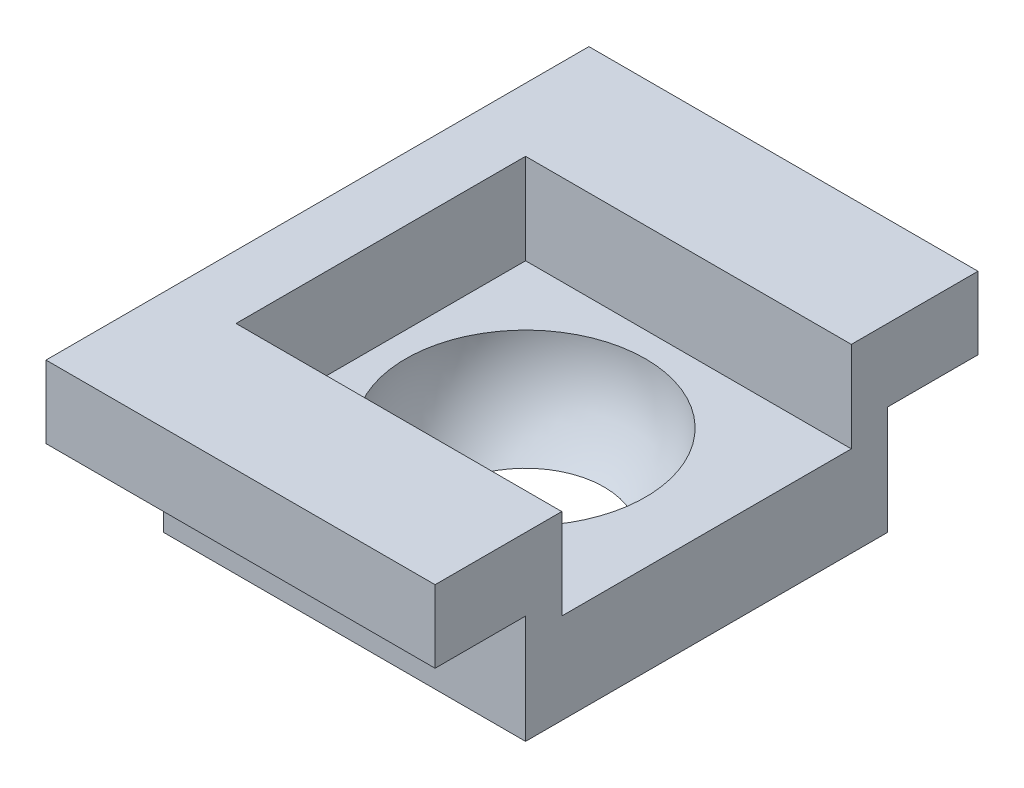
ISO-10303-21;
HEADER;
FILE_DESCRIPTION(('STEP AP214'),'2;1');
FILE_NAME('part.step','',(''),(''),'','','');
FILE_SCHEMA(('AUTOMOTIVE_DESIGN { 1 0 10303 214 1 1 1 1 }'));
ENDSEC;
DATA;
#1=APPLICATION_CONTEXT('core data for automotive mechanical design processes');
#2=APPLICATION_PROTOCOL_DEFINITION('international standard','automotive_design',2000,#1);
#3=PRODUCT_CONTEXT('',#1,'mechanical');
#4=PRODUCT('Part','Part','',(#3));
#5=PRODUCT_RELATED_PRODUCT_CATEGORY('part','',(#4));
#6=PRODUCT_DEFINITION_FORMATION('','',#4);
#7=PRODUCT_DEFINITION_CONTEXT('part definition',#1,'design');
#8=PRODUCT_DEFINITION('design','',#6,#7);
#9=PRODUCT_DEFINITION_SHAPE('','',#8);
#10=(LENGTH_UNIT() NAMED_UNIT(*) SI_UNIT(.MILLI.,.METRE.));
#11=(NAMED_UNIT(*) PLANE_ANGLE_UNIT() SI_UNIT($,.RADIAN.));
#12=(NAMED_UNIT(*) SI_UNIT($,.STERADIAN.) SOLID_ANGLE_UNIT());
#13=UNCERTAINTY_MEASURE_WITH_UNIT(LENGTH_MEASURE(1.E-05),#10,'distance_accuracy_value','');
#14=(GEOMETRIC_REPRESENTATION_CONTEXT(3) GLOBAL_UNCERTAINTY_ASSIGNED_CONTEXT((#13)) GLOBAL_UNIT_ASSIGNED_CONTEXT((#10,
#11,#12)) REPRESENTATION_CONTEXT('',''));
#15=CARTESIAN_POINT('',(0.,0.,0.));
#16=DIRECTION('',(0.,0.,1.));
#17=DIRECTION('',(1.,0.,0.));
#18=AXIS2_PLACEMENT_3D('',#15,#16,#17);
#19=CARTESIAN_POINT('',(-2.30598444461534,2.,-2.01602049593134));
#20=DIRECTION('',(1.,0.,0.));
#21=DIRECTION('',(0.,0.,-1.));
#22=AXIS2_PLACEMENT_3D('',#19,#20,#21);
#23=PLANE('',#22);
#24=DIRECTION('',(0.,0.,1.));
#25=VECTOR('',#24,1.);
#26=CARTESIAN_POINT('',(-2.30598444461534,2.2,-3.01602049593134));
#27=LINE('',#26,#25);
#28=CARTESIAN_POINT('',(-2.30598444461534,2.2,-2.01602049593134));
#29=VERTEX_POINT('',#28);
#30=CARTESIAN_POINT('',(-2.30598444461534,2.2,1.98397950406866));
#31=VERTEX_POINT('',#30);
#32=EDGE_CURVE('E11',#29,#31,#27,.T.);
#33=ORIENTED_EDGE('',*,*,#32,.F.);
#34=DIRECTION('',(0.,-1.,0.));
#35=VECTOR('',#34,1.);
#36=CARTESIAN_POINT('',(-2.30598444461534,2.,-2.01602049593134));
#37=LINE('',#36,#35);
#38=CARTESIAN_POINT('',(-2.30598444461534,1.,-2.01602049593134));
#39=VERTEX_POINT('',#38);
#40=EDGE_CURVE('E215',#29,#39,#37,.T.);
#41=ORIENTED_EDGE('',*,*,#40,.T.);
#42=DIRECTION('',(0.,0.,-1.));
#43=VECTOR('',#42,1.);
#44=CARTESIAN_POINT('',(-2.30598444461534,1.,-2.01602049593134));
#45=LINE('',#44,#43);
#46=CARTESIAN_POINT('',(-2.30598444461534,1.,1.98397950406866));
#47=VERTEX_POINT('',#46);
#48=EDGE_CURVE('E208',#47,#39,#45,.T.);
#49=ORIENTED_EDGE('',*,*,#48,.F.);
#50=DIRECTION('',(0.,-1.,0.));
#51=VECTOR('',#50,1.);
#52=CARTESIAN_POINT('',(-2.30598444461534,2.,1.98397950406866));
#53=LINE('',#52,#51);
#54=EDGE_CURVE('E44',#31,#47,#53,.T.);
#55=ORIENTED_EDGE('',*,*,#54,.F.);
#56=EDGE_LOOP('',(#33,#41,#49,#55));
#57=FACE_BOUND('',#56,.T.);
#58=ADVANCED_FACE('F36',(#57),#23,.F.);
#59=CARTESIAN_POINT('',(-2.30598444461534,2.,-2.01602049593134));
#60=DIRECTION('',(0.,0.,1.));
#61=DIRECTION('',(1.,0.,0.));
#62=AXIS2_PLACEMENT_3D('',#59,#60,#61);
#63=PLANE('',#62);
#64=DIRECTION('',(-1.,0.,0.));
#65=VECTOR('',#64,1.);
#66=CARTESIAN_POINT('',(1.69401555538492,2.2,-2.01602049593134));
#67=LINE('',#66,#65);
#68=CARTESIAN_POINT('',(1.69401555538466,2.2,-2.01602049593134));
#69=VERTEX_POINT('',#68);
#70=EDGE_CURVE('E52',#69,#29,#67,.T.);
#71=ORIENTED_EDGE('',*,*,#70,.F.);
#72=DIRECTION('',(0.,-1.,0.));
#73=VECTOR('',#72,1.);
#74=CARTESIAN_POINT('',(1.69401555538466,2.,-2.01602049593134));
#75=LINE('',#74,#73);
#76=CARTESIAN_POINT('',(1.69401555538466,1.,-2.01602049593134));
#77=VERTEX_POINT('',#76);
#78=EDGE_CURVE('E217',#69,#77,#75,.T.);
#79=ORIENTED_EDGE('',*,*,#78,.T.);
#80=DIRECTION('',(1.,0.,0.));
#81=VECTOR('',#80,1.);
#82=CARTESIAN_POINT('',(-2.30598444461534,1.,-2.01602049593134));
#83=LINE('',#82,#81);
#84=EDGE_CURVE('E199',#39,#77,#83,.T.);
#85=ORIENTED_EDGE('',*,*,#84,.F.);
#86=ORIENTED_EDGE('',*,*,#40,.F.);
#87=EDGE_LOOP('',(#71,#79,#85,#86));
#88=FACE_BOUND('',#87,.T.);
#89=ADVANCED_FACE('F246',(#88),#63,.F.);
#90=CARTESIAN_POINT('',(-2.30598444461534,2.,1.98397950406866));
#91=DIRECTION('',(0.,0.,-1.));
#92=DIRECTION('',(-1.,0.,0.));
#93=AXIS2_PLACEMENT_3D('',#90,#91,#92);
#94=PLANE('',#93);
#95=DIRECTION('',(1.,0.,0.));
#96=VECTOR('',#95,1.);
#97=CARTESIAN_POINT('',(-2.30598444461534,2.2,1.98397950406866));
#98=LINE('',#97,#96);
#99=CARTESIAN_POINT('',(1.69401555538492,2.2,1.98397950406866));
#100=VERTEX_POINT('',#99);
#101=EDGE_CURVE('E160',#31,#100,#98,.T.);
#102=ORIENTED_EDGE('',*,*,#101,.F.);
#103=ORIENTED_EDGE('',*,*,#54,.T.);
#104=DIRECTION('',(-1.,0.,0.));
#105=VECTOR('',#104,1.);
#106=CARTESIAN_POINT('',(-2.30598444461534,1.,1.98397950406866));
#107=LINE('',#106,#105);
#108=CARTESIAN_POINT('',(1.69401555538466,1.,1.98397950406866));
#109=VERTEX_POINT('',#108);
#110=EDGE_CURVE('E205',#109,#47,#107,.T.);
#111=ORIENTED_EDGE('',*,*,#110,.F.);
#112=DIRECTION('',(0.,-1.,0.));
#113=VECTOR('',#112,1.);
#114=CARTESIAN_POINT('',(1.69401555538466,2.,1.98397950406866));
#115=LINE('',#114,#113);
#116=EDGE_CURVE('E219',#100,#109,#115,.T.);
#117=ORIENTED_EDGE('',*,*,#116,.F.);
#118=EDGE_LOOP('',(#102,#103,#111,#117));
#119=FACE_BOUND('',#118,.T.);
#120=ADVANCED_FACE('F249',(#119),#94,.F.);
#121=CARTESIAN_POINT('',(0.,2.,0.));
#122=DIRECTION('',(0.,1.,0.));
#123=DIRECTION('',(0.,0.,1.));
#124=AXIS2_PLACEMENT_3D('',#121,#122,#123);
#125=PLANE('',#124);
#126=CARTESIAN_POINT('',(-0.305984444615342,2.,-0.0160204959313423));
#127=DIRECTION('',(0.,1.,0.));
#128=DIRECTION('',(0.,0.,1.));
#129=AXIS2_PLACEMENT_3D('',#126,#127,#128);
#130=CIRCLE('',#129,1.325);
#131=CARTESIAN_POINT('',(-0.305984444615342,2.,1.30897950406866));
#132=VERTEX_POINT('',#131);
#133=EDGE_CURVE('E211',#132,#132,#130,.F.);
#134=ORIENTED_EDGE('',*,*,#133,.T.);
#135=EDGE_LOOP('',(#134));
#136=FACE_BOUND('',#135,.T.);
#137=DIRECTION('',(0.,0.,-1.));
#138=VECTOR('',#137,1.);
#139=CARTESIAN_POINT('',(1.69401555538466,2.,-2.01602049593134));
#140=LINE('',#139,#138);
#141=CARTESIAN_POINT('',(1.69401555538466,2.,1.58397950406866));
#142=VERTEX_POINT('',#141);
#143=CARTESIAN_POINT('',(1.69401555538492,2.,-1.61602049593134));
#144=VERTEX_POINT('',#143);
#145=EDGE_CURVE('E212',#142,#144,#140,.T.);
#146=ORIENTED_EDGE('',*,*,#145,.T.);
#147=DIRECTION('',(1.,0.,0.));
#148=VECTOR('',#147,1.);
#149=CARTESIAN_POINT('',(1.51502065671139,2.,-1.61602049593134));
#150=LINE('',#149,#148);
#151=CARTESIAN_POINT('',(-1.90598444461534,2.,-1.61602049593134));
#152=VERTEX_POINT('',#151);
#153=EDGE_CURVE('E187',#152,#144,#150,.T.);
#154=ORIENTED_EDGE('',*,*,#153,.F.);
#155=DIRECTION('',(0.,0.,-1.));
#156=VECTOR('',#155,1.);
#157=CARTESIAN_POINT('',(-1.90598444461534,2.,1.58397950406866));
#158=LINE('',#157,#156);
#159=CARTESIAN_POINT('',(-1.90598444461534,2.,1.58397950406866));
#160=VERTEX_POINT('',#159);
#161=EDGE_CURVE('E171',#160,#152,#158,.T.);
#162=ORIENTED_EDGE('',*,*,#161,.F.);
#163=DIRECTION('',(-1.,0.,0.));
#164=VECTOR('',#163,1.);
#165=CARTESIAN_POINT('',(-1.90598444461534,2.,1.58397950406866));
#166=LINE('',#165,#164);
#167=EDGE_CURVE('E176',#142,#160,#166,.T.);
#168=ORIENTED_EDGE('',*,*,#167,.F.);
#169=EDGE_LOOP('',(#146,#154,#162,#168));
#170=FACE_BOUND('',#169,.T.);
#171=ADVANCED_FACE('F224',(#136,#170),#125,.T.);
#172=CARTESIAN_POINT('',(1.69401555538466,2.,-2.01602049593134));
#173=DIRECTION('',(-1.,0.,0.));
#174=DIRECTION('',(0.,0.,1.));
#175=AXIS2_PLACEMENT_3D('',#172,#173,#174);
#176=PLANE('',#175);
#177=DIRECTION('',(0.,0.,1.));
#178=VECTOR('',#177,1.);
#179=CARTESIAN_POINT('',(1.69401555538466,1.,-2.01602049593134));
#180=LINE('',#179,#178);
#181=EDGE_CURVE('E202',#77,#109,#180,.T.);
#182=ORIENTED_EDGE('',*,*,#181,.F.);
#183=ORIENTED_EDGE('',*,*,#78,.F.);
#184=DIRECTION('',(0.,0.,1.));
#185=VECTOR('',#184,1.);
#186=CARTESIAN_POINT('',(1.69401555538492,2.2,-3.01602049593134));
#187=LINE('',#186,#185);
#188=CARTESIAN_POINT('',(1.69401555538492,2.2,-3.01602049593134));
#189=VERTEX_POINT('',#188);
#190=EDGE_CURVE('E157',#189,#69,#187,.T.);
#191=ORIENTED_EDGE('',*,*,#190,.F.);
#192=DIRECTION('',(0.,-1.,0.));
#193=VECTOR('',#192,1.);
#194=CARTESIAN_POINT('',(1.69401555538492,3.,-3.01602049593134));
#195=LINE('',#194,#193);
#196=CARTESIAN_POINT('',(1.69401555538492,3.,-3.01602049593134));
#197=VERTEX_POINT('',#196);
#198=EDGE_CURVE('E132',#197,#189,#195,.T.);
#199=ORIENTED_EDGE('',*,*,#198,.F.);
#200=DIRECTION('',(0.,0.,-1.));
#201=VECTOR('',#200,1.);
#202=CARTESIAN_POINT('',(1.69401555538492,3.,-1.61602049593134));
#203=LINE('',#202,#201);
#204=CARTESIAN_POINT('',(1.69401555538492,3.,-1.61602049593134));
#205=VERTEX_POINT('',#204);
#206=EDGE_CURVE('E178',#205,#197,#203,.T.);
#207=ORIENTED_EDGE('',*,*,#206,.F.);
#208=DIRECTION('',(0.,-1.,0.));
#209=VECTOR('',#208,1.);
#210=CARTESIAN_POINT('',(1.69401555538492,3.,-1.61602049593134));
#211=LINE('',#210,#209);
#212=EDGE_CURVE('E194',#205,#144,#211,.T.);
#213=ORIENTED_EDGE('',*,*,#212,.T.);
#214=ORIENTED_EDGE('',*,*,#145,.F.);
#215=DIRECTION('',(0.,-1.,0.));
#216=VECTOR('',#215,1.);
#217=CARTESIAN_POINT('',(1.69401555538492,3.,1.58397950406866));
#218=LINE('',#217,#216);
#219=CARTESIAN_POINT('',(1.69401555538492,3.,1.58397950406866));
#220=VERTEX_POINT('',#219);
#221=EDGE_CURVE('E192',#220,#142,#218,.T.);
#222=ORIENTED_EDGE('',*,*,#221,.F.);
#223=DIRECTION('',(0.,0.,-1.));
#224=VECTOR('',#223,1.);
#225=CARTESIAN_POINT('',(1.69401555538492,3.,1.98397950406866));
#226=LINE('',#225,#224);
#227=CARTESIAN_POINT('',(1.69401555538492,3.,2.98397950406866));
#228=VERTEX_POINT('',#227);
#229=EDGE_CURVE('E180',#228,#220,#226,.T.);
#230=ORIENTED_EDGE('',*,*,#229,.F.);
#231=DIRECTION('',(0.,1.,0.));
#232=VECTOR('',#231,1.);
#233=CARTESIAN_POINT('',(1.69401555538492,3.,2.98397950406866));
#234=LINE('',#233,#232);
#235=CARTESIAN_POINT('',(1.69401555538492,2.2,2.98397950406866));
#236=VERTEX_POINT('',#235);
#237=EDGE_CURVE('E162',#236,#228,#234,.T.);
#238=ORIENTED_EDGE('',*,*,#237,.F.);
#239=DIRECTION('',(0.,0.,-1.));
#240=VECTOR('',#239,1.);
#241=CARTESIAN_POINT('',(1.69401555538492,2.2,2.98397950406866));
#242=LINE('',#241,#240);
#243=EDGE_CURVE('E167',#236,#100,#242,.T.);
#244=ORIENTED_EDGE('',*,*,#243,.T.);
#245=ORIENTED_EDGE('',*,*,#116,.T.);
#246=EDGE_LOOP('',(#182,#183,#191,#199,#207,#213,#214,#222,#230,#238,#244,#245));
#247=FACE_BOUND('',#246,.T.);
#248=ADVANCED_FACE('F231',(#247),#176,.F.);
#249=CARTESIAN_POINT('',(-0.305984444615342,2.,-0.0160204959313423));
#250=DIRECTION('',(0.,0.,1.));
#251=DIRECTION('',(-1.,0.,0.));
#252=AXIS2_PLACEMENT_3D('',#249,#250,#251);
#253=SPHERICAL_SURFACE('',#252,1.325);
#254=CARTESIAN_POINT('',(-0.305984444615342,2.,-0.0160204959313423));
#255=DIRECTION('',(0.,1.,0.));
#256=DIRECTION('',(0.,0.,1.));
#257=AXIS2_PLACEMENT_3D('',#254,#255,#256);
#258=SPHERICAL_SURFACE('',#257,1.325);
#259=ORIENTED_EDGE('',*,*,#133,.F.);
#260=EDGE_LOOP('',(#259));
#261=FACE_BOUND('',#260,.T.);
#262=CARTESIAN_POINT('',(-0.305984444615342,1.,-0.0160204959313423));
#263=DIRECTION('',(0.,-1.,0.));
#264=DIRECTION('',(0.,0.,-1.));
#265=AXIS2_PLACEMENT_3D('',#262,#263,#264);
#266=CIRCLE('',#265,0.869266932535686);
#267=CARTESIAN_POINT('',(-0.305984444615342,1.,-0.885287428467028));
#268=VERTEX_POINT('',#267);
#269=EDGE_CURVE('E39',#268,#268,#266,.T.);
#270=ORIENTED_EDGE('',*,*,#269,.T.);
#271=EDGE_LOOP('',(#270));
#272=FACE_BOUND('',#271,.T.);
#273=ADVANCED_FACE('F227',(#261,#272),#258,.F.);
#274=CARTESIAN_POINT('',(0.,1.,0.));
#275=DIRECTION('',(0.,-1.,0.));
#276=DIRECTION('',(0.,0.,-1.));
#277=AXIS2_PLACEMENT_3D('',#274,#275,#276);
#278=PLANE('',#277);
#279=ORIENTED_EDGE('',*,*,#269,.F.);
#280=EDGE_LOOP('',(#279));
#281=FACE_BOUND('',#280,.T.);
#282=ORIENTED_EDGE('',*,*,#48,.T.);
#283=ORIENTED_EDGE('',*,*,#84,.T.);
#284=ORIENTED_EDGE('',*,*,#181,.T.);
#285=ORIENTED_EDGE('',*,*,#110,.T.);
#286=EDGE_LOOP('',(#282,#283,#284,#285));
#287=FACE_BOUND('',#286,.T.);
#288=ADVANCED_FACE('F230',(#281,#287),#278,.T.);
#289=CARTESIAN_POINT('',(-1.90598444461534,3.,1.58397950406866));
#290=DIRECTION('',(-1.,0.,0.));
#291=DIRECTION('',(0.,0.,1.));
#292=AXIS2_PLACEMENT_3D('',#289,#290,#291);
#293=PLANE('',#292);
#294=ORIENTED_EDGE('',*,*,#161,.T.);
#295=DIRECTION('',(0.,-1.,0.));
#296=VECTOR('',#295,1.);
#297=CARTESIAN_POINT('',(-1.90598444461534,3.,-1.61602049593134));
#298=LINE('',#297,#296);
#299=CARTESIAN_POINT('',(-1.90598444461534,3.,-1.61602049593134));
#300=VERTEX_POINT('',#299);
#301=EDGE_CURVE('E197',#300,#152,#298,.T.);
#302=ORIENTED_EDGE('',*,*,#301,.F.);
#303=DIRECTION('',(0.,0.,-1.));
#304=VECTOR('',#303,1.);
#305=CARTESIAN_POINT('',(-1.90598444461534,3.,1.58397950406866));
#306=LINE('',#305,#304);
#307=CARTESIAN_POINT('',(-1.90598444461534,3.,1.58397950406866));
#308=VERTEX_POINT('',#307);
#309=EDGE_CURVE('E172',#308,#300,#306,.T.);
#310=ORIENTED_EDGE('',*,*,#309,.F.);
#311=DIRECTION('',(0.,-1.,0.));
#312=VECTOR('',#311,1.);
#313=CARTESIAN_POINT('',(-1.90598444461534,3.,1.58397950406866));
#314=LINE('',#313,#312);
#315=EDGE_CURVE('E184',#308,#160,#314,.T.);
#316=ORIENTED_EDGE('',*,*,#315,.T.);
#317=EDGE_LOOP('',(#294,#302,#310,#316));
#318=FACE_BOUND('',#317,.T.);
#319=ADVANCED_FACE('F238',(#318),#293,.F.);
#320=CARTESIAN_POINT('',(1.51502065671139,3.,-1.61602049593134));
#321=DIRECTION('',(0.,0.,-1.));
#322=DIRECTION('',(-1.,0.,0.));
#323=AXIS2_PLACEMENT_3D('',#320,#321,#322);
#324=PLANE('',#323);
#325=ORIENTED_EDGE('',*,*,#153,.T.);
#326=ORIENTED_EDGE('',*,*,#212,.F.);
#327=DIRECTION('',(1.,0.,0.));
#328=VECTOR('',#327,1.);
#329=CARTESIAN_POINT('',(-1.90598444461534,3.,-1.61602049593134));
#330=LINE('',#329,#328);
#331=EDGE_CURVE('E175',#300,#205,#330,.T.);
#332=ORIENTED_EDGE('',*,*,#331,.F.);
#333=ORIENTED_EDGE('',*,*,#301,.T.);
#334=EDGE_LOOP('',(#325,#326,#332,#333));
#335=FACE_BOUND('',#334,.T.);
#336=ADVANCED_FACE('F332',(#335),#324,.F.);
#337=CARTESIAN_POINT('',(-1.90598444461534,3.,1.58397950406866));
#338=DIRECTION('',(0.,0.,1.));
#339=DIRECTION('',(1.,0.,0.));
#340=AXIS2_PLACEMENT_3D('',#337,#338,#339);
#341=PLANE('',#340);
#342=ORIENTED_EDGE('',*,*,#167,.T.);
#343=ORIENTED_EDGE('',*,*,#315,.F.);
#344=DIRECTION('',(-1.,0.,0.));
#345=VECTOR('',#344,1.);
#346=CARTESIAN_POINT('',(1.51502065671139,3.,1.58397950406866));
#347=LINE('',#346,#345);
#348=EDGE_CURVE('E182',#220,#308,#347,.T.);
#349=ORIENTED_EDGE('',*,*,#348,.F.);
#350=ORIENTED_EDGE('',*,*,#221,.T.);
#351=EDGE_LOOP('',(#342,#343,#349,#350));
#352=FACE_BOUND('',#351,.T.);
#353=ADVANCED_FACE('F286',(#352),#341,.F.);
#354=CARTESIAN_POINT('',(0.,3.,0.));
#355=DIRECTION('',(0.,-1.,0.));
#356=DIRECTION('',(0.,0.,-1.));
#357=AXIS2_PLACEMENT_3D('',#354,#355,#356);
#358=PLANE('',#357);
#359=ORIENTED_EDGE('',*,*,#309,.T.);
#360=ORIENTED_EDGE('',*,*,#331,.T.);
#361=ORIENTED_EDGE('',*,*,#206,.T.);
#362=DIRECTION('',(1.,0.,0.));
#363=VECTOR('',#362,1.);
#364=CARTESIAN_POINT('',(1.69401555538492,3.,-3.01602049593134));
#365=LINE('',#364,#363);
#366=CARTESIAN_POINT('',(-2.60598444461534,3.,-3.01602049593134));
#367=VERTEX_POINT('',#366);
#368=EDGE_CURVE('E135',#367,#197,#365,.T.);
#369=ORIENTED_EDGE('',*,*,#368,.F.);
#370=DIRECTION('',(0.,0.,-1.));
#371=VECTOR('',#370,1.);
#372=CARTESIAN_POINT('',(-2.60598444461534,3.,-3.01602049593134));
#373=LINE('',#372,#371);
#374=CARTESIAN_POINT('',(-2.60598444461534,3.,2.98397950406866));
#375=VERTEX_POINT('',#374);
#376=EDGE_CURVE('E150',#375,#367,#373,.T.);
#377=ORIENTED_EDGE('',*,*,#376,.F.);
#378=DIRECTION('',(-1.,0.,0.));
#379=VECTOR('',#378,1.);
#380=CARTESIAN_POINT('',(-2.30598444461534,3.,2.98397950406866));
#381=LINE('',#380,#379);
#382=EDGE_CURVE('E165',#228,#375,#381,.T.);
#383=ORIENTED_EDGE('',*,*,#382,.F.);
#384=ORIENTED_EDGE('',*,*,#229,.T.);
#385=ORIENTED_EDGE('',*,*,#348,.T.);
#386=EDGE_LOOP('',(#359,#360,#361,#369,#377,#383,#384,#385));
#387=FACE_BOUND('',#386,.T.);
#388=ADVANCED_FACE('F281',(#387),#358,.F.);
#389=CARTESIAN_POINT('',(-2.30598444461534,2.2,2.98397950406866));
#390=DIRECTION('',(0.,1.,0.));
#391=DIRECTION('',(0.,0.,1.));
#392=AXIS2_PLACEMENT_3D('',#389,#390,#391);
#393=PLANE('',#392);
#394=ORIENTED_EDGE('',*,*,#101,.T.);
#395=ORIENTED_EDGE('',*,*,#243,.F.);
#396=DIRECTION('',(1.,0.,0.));
#397=VECTOR('',#396,1.);
#398=CARTESIAN_POINT('',(-2.30598444461534,2.2,2.98397950406866));
#399=LINE('',#398,#397);
#400=CARTESIAN_POINT('',(-2.60598444461534,2.2,2.98397950406866));
#401=VERTEX_POINT('',#400);
#402=EDGE_CURVE('E141',#401,#236,#399,.T.);
#403=ORIENTED_EDGE('',*,*,#402,.F.);
#404=DIRECTION('',(0.,0.,1.));
#405=VECTOR('',#404,1.);
#406=CARTESIAN_POINT('',(-2.60598444461534,2.2,-3.01602049593134));
#407=LINE('',#406,#405);
#408=CARTESIAN_POINT('',(-2.60598444461534,2.2,-3.01602049593134));
#409=VERTEX_POINT('',#408);
#410=EDGE_CURVE('E138',#409,#401,#407,.T.);
#411=ORIENTED_EDGE('',*,*,#410,.F.);
#412=DIRECTION('',(-1.,0.,0.));
#413=VECTOR('',#412,1.);
#414=CARTESIAN_POINT('',(1.69401555538492,2.2,-3.01602049593134));
#415=LINE('',#414,#413);
#416=EDGE_CURVE('E125',#189,#409,#415,.T.);
#417=ORIENTED_EDGE('',*,*,#416,.F.);
#418=ORIENTED_EDGE('',*,*,#190,.T.);
#419=ORIENTED_EDGE('',*,*,#70,.T.);
#420=ORIENTED_EDGE('',*,*,#32,.T.);
#421=EDGE_LOOP('',(#394,#395,#403,#411,#417,#418,#419,#420));
#422=FACE_BOUND('',#421,.T.);
#423=ADVANCED_FACE('F139',(#422),#393,.F.);
#424=CARTESIAN_POINT('',(0.,0.,2.98397950406866));
#425=DIRECTION('',(0.,0.,1.));
#426=DIRECTION('',(1.,0.,0.));
#427=AXIS2_PLACEMENT_3D('',#424,#425,#426);
#428=PLANE('',#427);
#429=ORIENTED_EDGE('',*,*,#382,.T.);
#430=DIRECTION('',(0.,1.,0.));
#431=VECTOR('',#430,1.);
#432=CARTESIAN_POINT('',(-2.60598444461534,3.,2.98397950406866));
#433=LINE('',#432,#431);
#434=EDGE_CURVE('E145',#401,#375,#433,.T.);
#435=ORIENTED_EDGE('',*,*,#434,.F.);
#436=ORIENTED_EDGE('',*,*,#402,.T.);
#437=ORIENTED_EDGE('',*,*,#237,.T.);
#438=EDGE_LOOP('',(#429,#435,#436,#437));
#439=FACE_BOUND('',#438,.T.);
#440=ADVANCED_FACE('F299',(#439),#428,.T.);
#441=CARTESIAN_POINT('',(0.,0.,-3.01602049593134));
#442=DIRECTION('',(0.,0.,-1.));
#443=DIRECTION('',(-1.,0.,0.));
#444=AXIS2_PLACEMENT_3D('',#441,#442,#443);
#445=PLANE('',#444);
#446=ORIENTED_EDGE('',*,*,#198,.T.);
#447=ORIENTED_EDGE('',*,*,#416,.T.);
#448=DIRECTION('',(0.,-1.,0.));
#449=VECTOR('',#448,1.);
#450=CARTESIAN_POINT('',(-2.60598444461534,3.,-3.01602049593134));
#451=LINE('',#450,#449);
#452=EDGE_CURVE('E130',#367,#409,#451,.T.);
#453=ORIENTED_EDGE('',*,*,#452,.F.);
#454=ORIENTED_EDGE('',*,*,#368,.T.);
#455=EDGE_LOOP('',(#446,#447,#453,#454));
#456=FACE_BOUND('',#455,.T.);
#457=ADVANCED_FACE('F127',(#456),#445,.T.);
#458=CARTESIAN_POINT('',(-2.60598444461534,0.,0.));
#459=DIRECTION('',(-1.,0.,0.));
#460=DIRECTION('',(0.,0.,1.));
#461=AXIS2_PLACEMENT_3D('',#458,#459,#460);
#462=PLANE('',#461);
#463=ORIENTED_EDGE('',*,*,#452,.T.);
#464=ORIENTED_EDGE('',*,*,#410,.T.);
#465=ORIENTED_EDGE('',*,*,#434,.T.);
#466=ORIENTED_EDGE('',*,*,#376,.T.);
#467=EDGE_LOOP('',(#463,#464,#465,#466));
#468=FACE_BOUND('',#467,.T.);
#469=ADVANCED_FACE('F148',(#468),#462,.T.);
#470=CLOSED_SHELL('',(#58,#89,#120,#171,#248,#273,#288,#319,#336,#353,#388,#423,#440,#457,#469));
#471=MANIFOLD_SOLID_BREP('B2',#470);
#472=ADVANCED_BREP_SHAPE_REPRESENTATION('',(#18,#471),#14);
#473=SHAPE_DEFINITION_REPRESENTATION(#9,#472);
ENDSEC;
END-ISO-10303-21;
